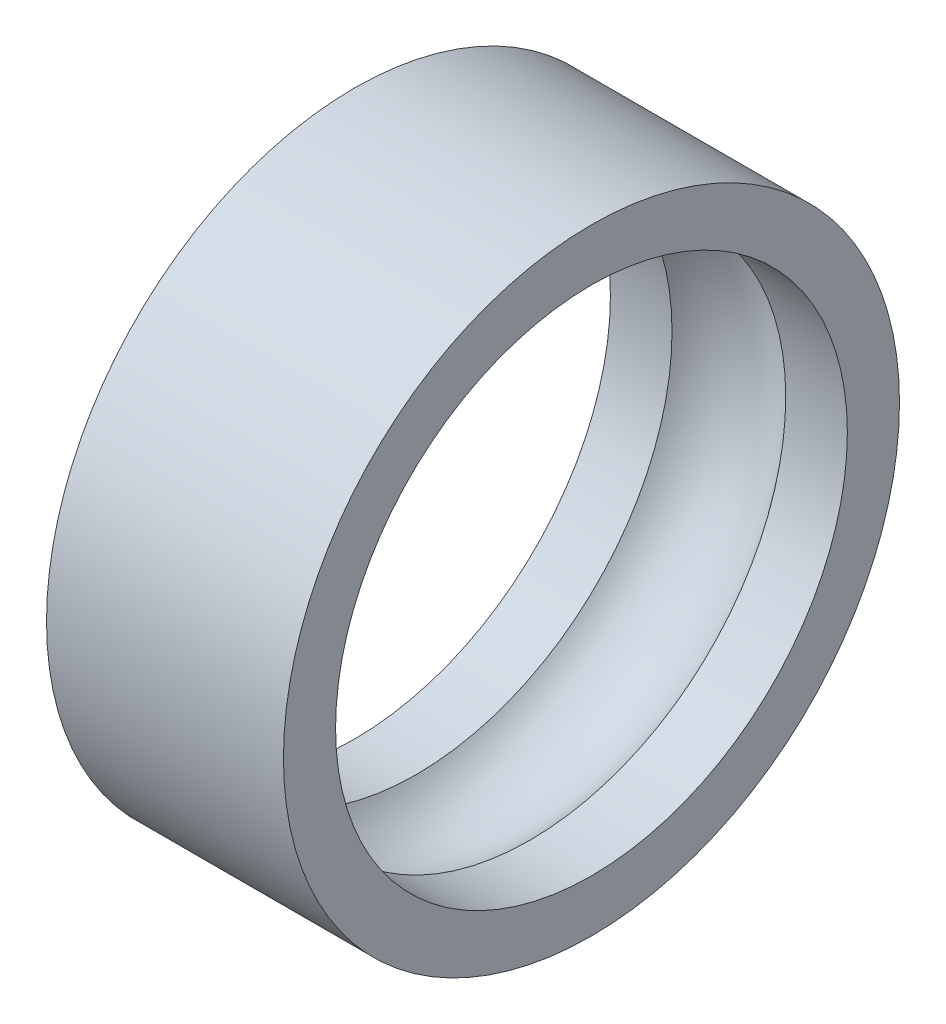
ISO-10303-21;
HEADER;
FILE_DESCRIPTION(('STEP AP214'),'2;1');
FILE_NAME('part.step','',(''),(''),'','','');
FILE_SCHEMA(('AUTOMOTIVE_DESIGN { 1 0 10303 214 1 1 1 1 }'));
ENDSEC;
DATA;
#1=APPLICATION_CONTEXT('core data for automotive mechanical design processes');
#2=APPLICATION_PROTOCOL_DEFINITION('international standard','automotive_design',2000,#1);
#3=PRODUCT_CONTEXT('',#1,'mechanical');
#4=PRODUCT('Part','Part','',(#3));
#5=PRODUCT_RELATED_PRODUCT_CATEGORY('part','',(#4));
#6=PRODUCT_DEFINITION_FORMATION('','',#4);
#7=PRODUCT_DEFINITION_CONTEXT('part definition',#1,'design');
#8=PRODUCT_DEFINITION('design','',#6,#7);
#9=PRODUCT_DEFINITION_SHAPE('','',#8);
#10=(LENGTH_UNIT() NAMED_UNIT(*) SI_UNIT(.MILLI.,.METRE.));
#11=(NAMED_UNIT(*) PLANE_ANGLE_UNIT() SI_UNIT($,.RADIAN.));
#12=(NAMED_UNIT(*) SI_UNIT($,.STERADIAN.) SOLID_ANGLE_UNIT());
#13=UNCERTAINTY_MEASURE_WITH_UNIT(LENGTH_MEASURE(1.E-05),#10,'distance_accuracy_value','');
#14=(GEOMETRIC_REPRESENTATION_CONTEXT(3) GLOBAL_UNCERTAINTY_ASSIGNED_CONTEXT((#13)) GLOBAL_UNIT_ASSIGNED_CONTEXT((#10,
#11,#12)) REPRESENTATION_CONTEXT('',''));
#15=CARTESIAN_POINT('',(0.,0.,0.));
#16=DIRECTION('',(0.,0.,1.));
#17=DIRECTION('',(1.,0.,0.));
#18=AXIS2_PLACEMENT_3D('',#15,#16,#17);
#19=CARTESIAN_POINT('',(2.5,6.5,0.));
#20=DIRECTION('',(1.,0.,0.));
#21=DIRECTION('',(0.,0.,-1.));
#22=AXIS2_PLACEMENT_3D('',#19,#20,#21);
#23=PLANE('',#22);
#24=CARTESIAN_POINT('',(2.5,0.,0.));
#25=DIRECTION('',(1.,0.,0.));
#26=DIRECTION('',(0.,0.,-1.));
#27=AXIS2_PLACEMENT_3D('',#24,#25,#26);
#28=CIRCLE('',#27,6.5);
#29=CARTESIAN_POINT('',(2.5,0.,-6.5));
#30=VERTEX_POINT('',#29);
#31=EDGE_CURVE('E10',#30,#30,#28,.T.);
#32=ORIENTED_EDGE('',*,*,#31,.T.);
#33=EDGE_LOOP('',(#32));
#34=FACE_BOUND('',#33,.T.);
#35=CARTESIAN_POINT('',(2.5,0.,0.));
#36=DIRECTION('',(1.,0.,0.));
#37=DIRECTION('',(0.,0.,-1.));
#38=AXIS2_PLACEMENT_3D('',#35,#36,#37);
#39=CIRCLE('',#38,5.4);
#40=CARTESIAN_POINT('',(2.5,0.,-5.4));
#41=VERTEX_POINT('',#40);
#42=EDGE_CURVE('E59',#41,#41,#39,.T.);
#43=ORIENTED_EDGE('',*,*,#42,.F.);
#44=EDGE_LOOP('',(#43));
#45=FACE_BOUND('',#44,.T.);
#46=ADVANCED_FACE('F37',(#34,#45),#23,.T.);
#47=CARTESIAN_POINT('',(0.,0.,0.));
#48=DIRECTION('',(1.,0.,0.));
#49=DIRECTION('',(0.,0.,-1.));
#50=AXIS2_PLACEMENT_3D('',#47,#48,#49);
#51=CYLINDRICAL_SURFACE('',#50,6.5);
#52=CARTESIAN_POINT('',(-2.5,0.,0.));
#53=DIRECTION('',(1.,0.,0.));
#54=DIRECTION('',(0.,0.,-1.));
#55=AXIS2_PLACEMENT_3D('',#52,#53,#54);
#56=CIRCLE('',#55,6.5);
#57=CARTESIAN_POINT('',(-2.5,0.,-6.5));
#58=VERTEX_POINT('',#57);
#59=EDGE_CURVE('E43',#58,#58,#56,.T.);
#60=ORIENTED_EDGE('',*,*,#59,.T.);
#61=EDGE_LOOP('',(#60));
#62=FACE_BOUND('',#61,.T.);
#63=ORIENTED_EDGE('',*,*,#31,.F.);
#64=EDGE_LOOP('',(#63));
#65=FACE_BOUND('',#64,.T.);
#66=ADVANCED_FACE('F67',(#62,#65),#51,.T.);
#67=CARTESIAN_POINT('',(-2.5,5.4,0.));
#68=DIRECTION('',(-1.,0.,0.));
#69=DIRECTION('',(0.,0.,1.));
#70=AXIS2_PLACEMENT_3D('',#67,#68,#69);
#71=PLANE('',#70);
#72=CARTESIAN_POINT('',(-2.5,0.,0.));
#73=DIRECTION('',(1.,0.,0.));
#74=DIRECTION('',(0.,0.,-1.));
#75=AXIS2_PLACEMENT_3D('',#72,#73,#74);
#76=CIRCLE('',#75,5.4);
#77=CARTESIAN_POINT('',(-2.5,0.,-5.4));
#78=VERTEX_POINT('',#77);
#79=EDGE_CURVE('E47',#78,#78,#76,.T.);
#80=ORIENTED_EDGE('',*,*,#79,.T.);
#81=EDGE_LOOP('',(#80));
#82=FACE_BOUND('',#81,.T.);
#83=ORIENTED_EDGE('',*,*,#59,.F.);
#84=EDGE_LOOP('',(#83));
#85=FACE_BOUND('',#84,.T.);
#86=ADVANCED_FACE('F71',(#82,#85),#71,.T.);
#87=CARTESIAN_POINT('',(0.,0.,0.));
#88=DIRECTION('',(1.,0.,0.));
#89=DIRECTION('',(0.,0.,-1.));
#90=AXIS2_PLACEMENT_3D('',#87,#88,#89);
#91=CYLINDRICAL_SURFACE('',#90,5.4);
#92=CARTESIAN_POINT('',(-1.2,0.,0.));
#93=DIRECTION('',(1.,0.,0.));
#94=DIRECTION('',(0.,0.,-1.));
#95=AXIS2_PLACEMENT_3D('',#92,#93,#94);
#96=CIRCLE('',#95,5.4);
#97=CARTESIAN_POINT('',(-1.2,0.,-5.4));
#98=VERTEX_POINT('',#97);
#99=EDGE_CURVE('E51',#98,#98,#96,.T.);
#100=ORIENTED_EDGE('',*,*,#99,.T.);
#101=EDGE_LOOP('',(#100));
#102=FACE_BOUND('',#101,.T.);
#103=ORIENTED_EDGE('',*,*,#79,.F.);
#104=EDGE_LOOP('',(#103));
#105=FACE_BOUND('',#104,.T.);
#106=ADVANCED_FACE('F75',(#102,#105),#91,.F.);
#107=CARTESIAN_POINT('',(0.,0.,0.));
#108=DIRECTION('',(1.,0.,0.));
#109=DIRECTION('',(0.,0.,-1.));
#110=AXIS2_PLACEMENT_3D('',#107,#108,#109);
#111=TOROIDAL_SURFACE('',#110,4.5,1.5);
#112=CARTESIAN_POINT('',(1.2,0.,0.));
#113=DIRECTION('',(1.,0.,0.));
#114=DIRECTION('',(0.,0.,-1.));
#115=AXIS2_PLACEMENT_3D('',#112,#113,#114);
#116=CIRCLE('',#115,5.4);
#117=CARTESIAN_POINT('',(1.2,0.,-5.4));
#118=VERTEX_POINT('',#117);
#119=EDGE_CURVE('E56',#118,#118,#116,.T.);
#120=ORIENTED_EDGE('',*,*,#119,.T.);
#121=EDGE_LOOP('',(#120));
#122=FACE_BOUND('',#121,.T.);
#123=ORIENTED_EDGE('',*,*,#99,.F.);
#124=EDGE_LOOP('',(#123));
#125=FACE_BOUND('',#124,.T.);
#126=ADVANCED_FACE('F82',(#122,#125),#111,.F.);
#127=CARTESIAN_POINT('',(0.,0.,0.));
#128=DIRECTION('',(1.,0.,0.));
#129=DIRECTION('',(0.,0.,-1.));
#130=AXIS2_PLACEMENT_3D('',#127,#128,#129);
#131=CYLINDRICAL_SURFACE('',#130,5.4);
#132=ORIENTED_EDGE('',*,*,#42,.T.);
#133=EDGE_LOOP('',(#132));
#134=FACE_BOUND('',#133,.T.);
#135=ORIENTED_EDGE('',*,*,#119,.F.);
#136=EDGE_LOOP('',(#135));
#137=FACE_BOUND('',#136,.T.);
#138=ADVANCED_FACE('F63',(#134,#137),#131,.F.);
#139=CLOSED_SHELL('',(#46,#66,#86,#106,#126,#138));
#140=MANIFOLD_SOLID_BREP('B2',#139);
#141=ADVANCED_BREP_SHAPE_REPRESENTATION('',(#18,#140),#14);
#142=SHAPE_DEFINITION_REPRESENTATION(#9,#141);
ENDSEC;
END-ISO-10303-21;
